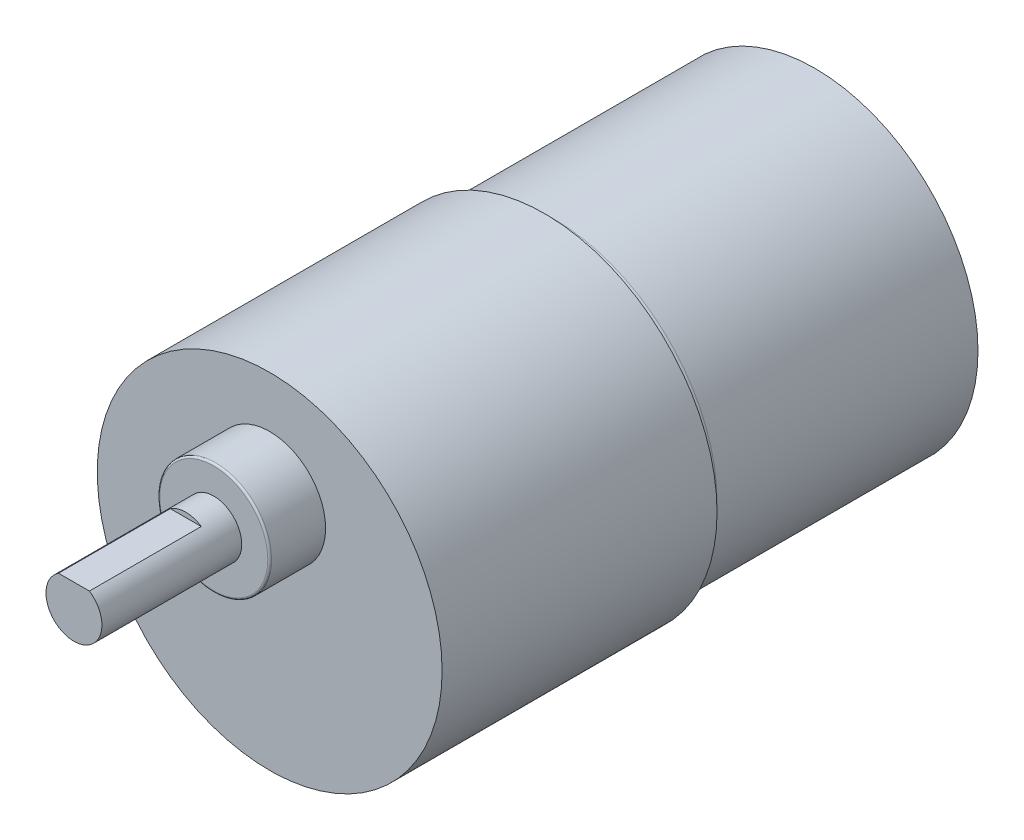
ISO-10303-21;
HEADER;
FILE_DESCRIPTION(('STEP AP214'),'2;1');
FILE_NAME('part.step','',(''),(''),'','','');
FILE_SCHEMA(('AUTOMOTIVE_DESIGN { 1 0 10303 214 1 1 1 1 }'));
ENDSEC;
DATA;
#1=APPLICATION_CONTEXT('core data for automotive mechanical design processes');
#2=APPLICATION_PROTOCOL_DEFINITION('international standard','automotive_design',2000,#1);
#3=PRODUCT_CONTEXT('',#1,'mechanical');
#4=PRODUCT('Part','Part','',(#3));
#5=PRODUCT_RELATED_PRODUCT_CATEGORY('part','',(#4));
#6=PRODUCT_DEFINITION_FORMATION('','',#4);
#7=PRODUCT_DEFINITION_CONTEXT('part definition',#1,'design');
#8=PRODUCT_DEFINITION('design','',#6,#7);
#9=PRODUCT_DEFINITION_SHAPE('','',#8);
#10=(LENGTH_UNIT() NAMED_UNIT(*) SI_UNIT(.MILLI.,.METRE.));
#11=(NAMED_UNIT(*) PLANE_ANGLE_UNIT() SI_UNIT($,.RADIAN.));
#12=(NAMED_UNIT(*) SI_UNIT($,.STERADIAN.) SOLID_ANGLE_UNIT());
#13=UNCERTAINTY_MEASURE_WITH_UNIT(LENGTH_MEASURE(1.E-05),#10,'distance_accuracy_value','');
#14=(GEOMETRIC_REPRESENTATION_CONTEXT(3) GLOBAL_UNCERTAINTY_ASSIGNED_CONTEXT((#13)) GLOBAL_UNIT_ASSIGNED_CONTEXT((#10,
#11,#12)) REPRESENTATION_CONTEXT('',''));
#15=CARTESIAN_POINT('',(0.,0.,0.));
#16=DIRECTION('',(0.,0.,1.));
#17=DIRECTION('',(1.,0.,0.));
#18=AXIS2_PLACEMENT_3D('',#15,#16,#17);
#19=CARTESIAN_POINT('',(0.,7.,67.5));
#20=DIRECTION('',(0.,0.,1.));
#21=DIRECTION('',(1.,0.,0.));
#22=AXIS2_PLACEMENT_3D('',#19,#20,#21);
#23=PLANE('',#22);
#24=CARTESIAN_POINT('',(0.,7.,67.5));
#25=DIRECTION('',(0.,0.,1.));
#26=DIRECTION('',(1.,0.,0.));
#27=AXIS2_PLACEMENT_3D('',#24,#25,#26);
#28=CIRCLE('',#27,3.);
#29=CARTESIAN_POINT('',(1.6583123951777,9.5,67.5));
#30=VERTEX_POINT('',#29);
#31=CARTESIAN_POINT('',(-1.6583123951777,9.5,67.5));
#32=VERTEX_POINT('',#31);
#33=EDGE_CURVE('E73',#30,#32,#28,.T.);
#34=ORIENTED_EDGE('',*,*,#33,.T.);
#35=DIRECTION('',(1.,0.,0.));
#36=VECTOR('',#35,1.);
#37=CARTESIAN_POINT('',(-1.6583123951777,9.5,67.5));
#38=LINE('',#37,#36);
#39=EDGE_CURVE('E79',#32,#30,#38,.T.);
#40=ORIENTED_EDGE('',*,*,#39,.T.);
#41=EDGE_LOOP('',(#34,#40));
#42=FACE_BOUND('',#41,.T.);
#43=ADVANCED_FACE('F41',(#42),#23,.T.);
#44=CARTESIAN_POINT('',(0.,0.,29.));
#45=DIRECTION('',(0.,0.,-1.));
#46=DIRECTION('',(-1.,0.,0.));
#47=AXIS2_PLACEMENT_3D('',#44,#45,#46);
#48=CYLINDRICAL_SURFACE('',#47,17.5);
#49=CARTESIAN_POINT('',(0.,0.,28.));
#50=DIRECTION('',(0.,0.,1.));
#51=DIRECTION('',(1.,0.,0.));
#52=AXIS2_PLACEMENT_3D('',#49,#50,#51);
#53=CIRCLE('',#52,17.5);
#54=CARTESIAN_POINT('',(17.5,0.,28.));
#55=VERTEX_POINT('',#54);
#56=EDGE_CURVE('E112',#55,#55,#53,.F.);
#57=ORIENTED_EDGE('',*,*,#56,.T.);
#58=EDGE_LOOP('',(#57));
#59=FACE_BOUND('',#58,.T.);
#60=CARTESIAN_POINT('',(0.,0.,0.));
#61=DIRECTION('',(0.,0.,1.));
#62=DIRECTION('',(1.,0.,0.));
#63=AXIS2_PLACEMENT_3D('',#60,#61,#62);
#64=CIRCLE('',#63,17.5);
#65=CARTESIAN_POINT('',(17.5,0.,0.));
#66=VERTEX_POINT('',#65);
#67=EDGE_CURVE('E101',#66,#66,#64,.T.);
#68=ORIENTED_EDGE('',*,*,#67,.T.);
#69=EDGE_LOOP('',(#68));
#70=FACE_BOUND('',#69,.T.);
#71=ADVANCED_FACE('F133',(#59,#70),#48,.T.);
#72=CARTESIAN_POINT('',(0.,0.,0.));
#73=DIRECTION('',(0.,0.,1.));
#74=DIRECTION('',(1.,0.,0.));
#75=AXIS2_PLACEMENT_3D('',#72,#73,#74);
#76=PLANE('',#75);
#77=ORIENTED_EDGE('',*,*,#67,.F.);
#78=EDGE_LOOP('',(#77));
#79=FACE_BOUND('',#78,.T.);
#80=ADVANCED_FACE('F138',(#79),#76,.F.);
#81=CARTESIAN_POINT('',(0.,0.,28.));
#82=DIRECTION('',(0.,0.,1.));
#83=DIRECTION('',(1.,0.,0.));
#84=AXIS2_PLACEMENT_3D('',#81,#82,#83);
#85=TOROIDAL_SURFACE('',#84,16.5,1.);
#86=ORIENTED_EDGE('',*,*,#56,.F.);
#87=EDGE_LOOP('',(#86));
#88=FACE_BOUND('',#87,.T.);
#89=CARTESIAN_POINT('',(0.,0.,29.));
#90=DIRECTION('',(0.,0.,1.));
#91=DIRECTION('',(1.,0.,0.));
#92=AXIS2_PLACEMENT_3D('',#89,#90,#91);
#93=CIRCLE('',#92,16.5);
#94=CARTESIAN_POINT('',(16.5,0.,29.));
#95=VERTEX_POINT('',#94);
#96=EDGE_CURVE('E108',#95,#95,#93,.T.);
#97=ORIENTED_EDGE('',*,*,#96,.F.);
#98=EDGE_LOOP('',(#97));
#99=FACE_BOUND('',#98,.T.);
#100=ADVANCED_FACE('F158',(#88,#99),#85,.T.);
#101=CARTESIAN_POINT('',(0.,0.,58.5));
#102=DIRECTION('',(0.,0.,-1.));
#103=DIRECTION('',(-1.,0.,0.));
#104=AXIS2_PLACEMENT_3D('',#101,#102,#103);
#105=CYLINDRICAL_SURFACE('',#104,18.5);
#106=CARTESIAN_POINT('',(0.,0.,58.5));
#107=DIRECTION('',(0.,0.,1.));
#108=DIRECTION('',(1.,0.,0.));
#109=AXIS2_PLACEMENT_3D('',#106,#107,#108);
#110=CIRCLE('',#109,18.5);
#111=CARTESIAN_POINT('',(18.5,0.,58.5));
#112=VERTEX_POINT('',#111);
#113=EDGE_CURVE('E97',#112,#112,#110,.T.);
#114=ORIENTED_EDGE('',*,*,#113,.F.);
#115=EDGE_LOOP('',(#114));
#116=FACE_BOUND('',#115,.T.);
#117=CARTESIAN_POINT('',(0.,0.,29.));
#118=DIRECTION('',(0.,0.,1.));
#119=DIRECTION('',(1.,0.,0.));
#120=AXIS2_PLACEMENT_3D('',#117,#118,#119);
#121=CIRCLE('',#120,18.5);
#122=CARTESIAN_POINT('',(18.5,0.,29.));
#123=VERTEX_POINT('',#122);
#124=EDGE_CURVE('E91',#123,#123,#121,.T.);
#125=ORIENTED_EDGE('',*,*,#124,.T.);
#126=EDGE_LOOP('',(#125));
#127=FACE_BOUND('',#126,.T.);
#128=ADVANCED_FACE('F151',(#116,#127),#105,.T.);
#129=CARTESIAN_POINT('',(0.,0.,58.5));
#130=DIRECTION('',(0.,0.,1.));
#131=DIRECTION('',(1.,0.,0.));
#132=AXIS2_PLACEMENT_3D('',#129,#130,#131);
#133=PLANE('',#132);
#134=CARTESIAN_POINT('',(0.,7.,58.5));
#135=DIRECTION('',(0.,0.,1.));
#136=DIRECTION('',(1.,0.,0.));
#137=AXIS2_PLACEMENT_3D('',#134,#135,#136);
#138=CIRCLE('',#137,6.);
#139=CARTESIAN_POINT('',(6.,7.,58.5));
#140=VERTEX_POINT('',#139);
#141=EDGE_CURVE('E86',#140,#140,#138,.T.);
#142=ORIENTED_EDGE('',*,*,#141,.F.);
#143=EDGE_LOOP('',(#142));
#144=FACE_BOUND('',#143,.T.);
#145=ORIENTED_EDGE('',*,*,#113,.T.);
#146=EDGE_LOOP('',(#145));
#147=FACE_BOUND('',#146,.T.);
#148=ADVANCED_FACE('F148',(#144,#147),#133,.T.);
#149=CARTESIAN_POINT('',(0.,0.,29.));
#150=DIRECTION('',(0.,0.,1.));
#151=DIRECTION('',(1.,0.,0.));
#152=AXIS2_PLACEMENT_3D('',#149,#150,#151);
#153=PLANE('',#152);
#154=ORIENTED_EDGE('',*,*,#96,.T.);
#155=EDGE_LOOP('',(#154));
#156=FACE_BOUND('',#155,.T.);
#157=ORIENTED_EDGE('',*,*,#124,.F.);
#158=EDGE_LOOP('',(#157));
#159=FACE_BOUND('',#158,.T.);
#160=ADVANCED_FACE('F146',(#156,#159),#153,.F.);
#161=CARTESIAN_POINT('',(0.,7.,64.5));
#162=DIRECTION('',(0.,0.,-1.));
#163=DIRECTION('',(-1.,0.,0.));
#164=AXIS2_PLACEMENT_3D('',#161,#162,#163);
#165=CYLINDRICAL_SURFACE('',#164,6.);
#166=CARTESIAN_POINT('',(0.,7.,64.3));
#167=DIRECTION('',(0.,0.,1.));
#168=DIRECTION('',(1.,0.,0.));
#169=AXIS2_PLACEMENT_3D('',#166,#167,#168);
#170=CIRCLE('',#169,6.);
#171=CARTESIAN_POINT('',(6.,7.,64.3));
#172=VERTEX_POINT('',#171);
#173=EDGE_CURVE('E11',#172,#172,#170,.F.);
#174=ORIENTED_EDGE('',*,*,#173,.T.);
#175=EDGE_LOOP('',(#174));
#176=FACE_BOUND('',#175,.T.);
#177=ORIENTED_EDGE('',*,*,#141,.T.);
#178=EDGE_LOOP('',(#177));
#179=FACE_BOUND('',#178,.T.);
#180=ADVANCED_FACE('F128',(#176,#179),#165,.T.);
#181=CARTESIAN_POINT('',(0.,0.,64.5));
#182=DIRECTION('',(0.,0.,1.));
#183=DIRECTION('',(1.,0.,0.));
#184=AXIS2_PLACEMENT_3D('',#181,#182,#183);
#185=PLANE('',#184);
#186=CARTESIAN_POINT('',(0.,7.,64.5));
#187=DIRECTION('',(0.,0.,1.));
#188=DIRECTION('',(1.,0.,0.));
#189=AXIS2_PLACEMENT_3D('',#186,#187,#188);
#190=CIRCLE('',#189,3.);
#191=CARTESIAN_POINT('',(3.,7.,64.5));
#192=VERTEX_POINT('',#191);
#193=EDGE_CURVE('E77',#192,#192,#190,.T.);
#194=ORIENTED_EDGE('',*,*,#193,.F.);
#195=EDGE_LOOP('',(#194));
#196=FACE_BOUND('',#195,.T.);
#197=CARTESIAN_POINT('',(0.,7.,64.5));
#198=DIRECTION('',(0.,0.,1.));
#199=DIRECTION('',(1.,0.,0.));
#200=AXIS2_PLACEMENT_3D('',#197,#198,#199);
#201=CIRCLE('',#200,5.8);
#202=CARTESIAN_POINT('',(5.8,7.,64.5));
#203=VERTEX_POINT('',#202);
#204=EDGE_CURVE('E50',#203,#203,#201,.T.);
#205=ORIENTED_EDGE('',*,*,#204,.T.);
#206=EDGE_LOOP('',(#205));
#207=FACE_BOUND('',#206,.T.);
#208=ADVANCED_FACE('F119',(#196,#207),#185,.T.);
#209=CARTESIAN_POINT('',(0.,7.,64.3));
#210=DIRECTION('',(0.,0.,1.));
#211=DIRECTION('',(1.,0.,0.));
#212=AXIS2_PLACEMENT_3D('',#209,#210,#211);
#213=TOROIDAL_SURFACE('',#212,5.8,0.2);
#214=ORIENTED_EDGE('',*,*,#173,.F.);
#215=EDGE_LOOP('',(#214));
#216=FACE_BOUND('',#215,.T.);
#217=ORIENTED_EDGE('',*,*,#204,.F.);
#218=EDGE_LOOP('',(#217));
#219=FACE_BOUND('',#218,.T.);
#220=ADVANCED_FACE('F43',(#216,#219),#213,.T.);
#221=CARTESIAN_POINT('',(0.,7.,67.5));
#222=DIRECTION('',(0.,0.,-1.));
#223=DIRECTION('',(-1.,0.,0.));
#224=AXIS2_PLACEMENT_3D('',#221,#222,#223);
#225=CYLINDRICAL_SURFACE('',#224,3.);
#226=ORIENTED_EDGE('',*,*,#33,.F.);
#227=DIRECTION('',(0.,0.,-1.));
#228=VECTOR('',#227,1.);
#229=CARTESIAN_POINT('',(1.6583123951777,9.5,79.5));
#230=LINE('',#229,#228);
#231=CARTESIAN_POINT('',(1.6583123951777,9.5,79.5));
#232=VERTEX_POINT('',#231);
#233=EDGE_CURVE('E57',#232,#30,#230,.T.);
#234=ORIENTED_EDGE('',*,*,#233,.F.);
#235=CARTESIAN_POINT('',(0.,7.,79.5));
#236=DIRECTION('',(0.,0.,-1.));
#237=DIRECTION('',(-1.,0.,0.));
#238=AXIS2_PLACEMENT_3D('',#235,#236,#237);
#239=CIRCLE('',#238,3.);
#240=CARTESIAN_POINT('',(-1.6583123951777,9.5,79.5));
#241=VERTEX_POINT('',#240);
#242=EDGE_CURVE('E75',#232,#241,#239,.T.);
#243=ORIENTED_EDGE('',*,*,#242,.T.);
#244=DIRECTION('',(0.,0.,-1.));
#245=VECTOR('',#244,1.);
#246=CARTESIAN_POINT('',(-1.6583123951777,9.5,79.5));
#247=LINE('',#246,#245);
#248=EDGE_CURVE('E63',#241,#32,#247,.T.);
#249=ORIENTED_EDGE('',*,*,#248,.T.);
#250=EDGE_LOOP('',(#226,#234,#243,#249));
#251=FACE_BOUND('',#250,.T.);
#252=ORIENTED_EDGE('',*,*,#193,.T.);
#253=EDGE_LOOP('',(#252));
#254=FACE_BOUND('',#253,.T.);
#255=ADVANCED_FACE('F70',(#251,#254),#225,.T.);
#256=CARTESIAN_POINT('',(-1.6583123951777,9.5,79.5));
#257=DIRECTION('',(0.,1.,0.));
#258=DIRECTION('',(0.,0.,1.));
#259=AXIS2_PLACEMENT_3D('',#256,#257,#258);
#260=PLANE('',#259);
#261=ORIENTED_EDGE('',*,*,#39,.F.);
#262=ORIENTED_EDGE('',*,*,#248,.F.);
#263=DIRECTION('',(1.,0.,0.));
#264=VECTOR('',#263,1.);
#265=CARTESIAN_POINT('',(-1.6583123951777,9.5,79.5));
#266=LINE('',#265,#264);
#267=EDGE_CURVE('E83',#241,#232,#266,.T.);
#268=ORIENTED_EDGE('',*,*,#267,.T.);
#269=ORIENTED_EDGE('',*,*,#233,.T.);
#270=EDGE_LOOP('',(#261,#262,#268,#269));
#271=FACE_BOUND('',#270,.T.);
#272=ADVANCED_FACE('F80',(#271),#260,.T.);
#273=CARTESIAN_POINT('',(0.,7.,79.5));
#274=DIRECTION('',(0.,0.,-1.));
#275=DIRECTION('',(-1.,0.,0.));
#276=AXIS2_PLACEMENT_3D('',#273,#274,#275);
#277=PLANE('',#276);
#278=ORIENTED_EDGE('',*,*,#267,.F.);
#279=ORIENTED_EDGE('',*,*,#242,.F.);
#280=EDGE_LOOP('',(#278,#279));
#281=FACE_BOUND('',#280,.T.);
#282=ADVANCED_FACE('F219',(#281),#277,.F.);
#283=CLOSED_SHELL('',(#43,#71,#80,#100,#128,#148,#160,#180,#208,#220,#255,#272,#282));
#284=MANIFOLD_SOLID_BREP('B2',#283);
#285=ADVANCED_BREP_SHAPE_REPRESENTATION('',(#18,#284),#14);
#286=SHAPE_DEFINITION_REPRESENTATION(#9,#285);
ENDSEC;
END-ISO-10303-21;
